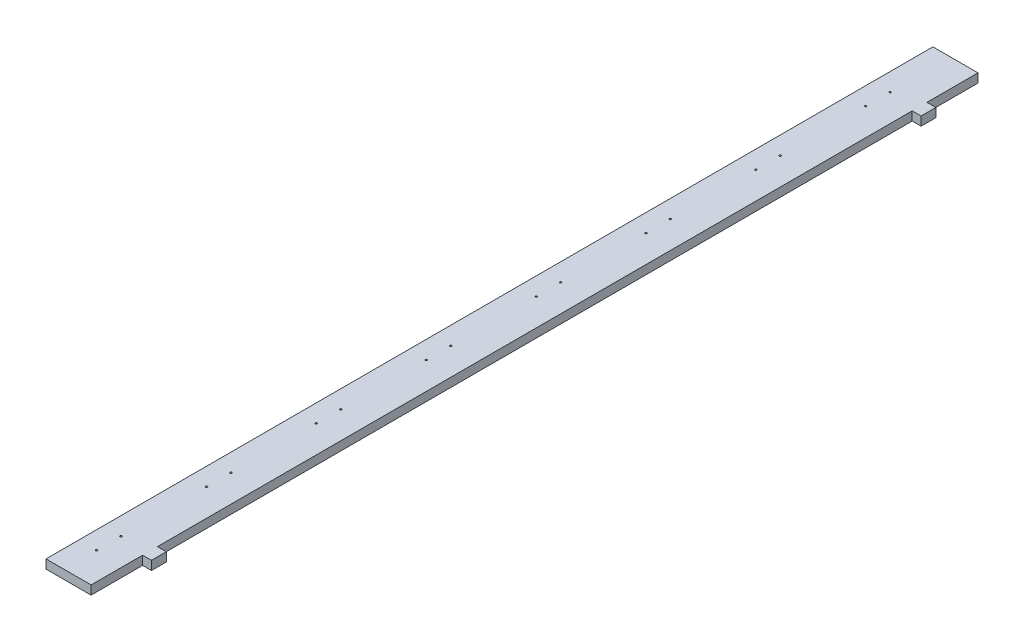
ISO-10303-21;
HEADER;
FILE_DESCRIPTION(('STEP AP214'),'2;1');
FILE_NAME('part.step','',(''),(''),'','','');
FILE_SCHEMA(('AUTOMOTIVE_DESIGN { 1 0 10303 214 1 1 1 1 }'));
ENDSEC;
DATA;
#1=APPLICATION_CONTEXT('core data for automotive mechanical design processes');
#2=APPLICATION_PROTOCOL_DEFINITION('international standard','automotive_design',2000,#1);
#3=PRODUCT_CONTEXT('',#1,'mechanical');
#4=PRODUCT('Part','Part','',(#3));
#5=PRODUCT_RELATED_PRODUCT_CATEGORY('part','',(#4));
#6=PRODUCT_DEFINITION_FORMATION('','',#4);
#7=PRODUCT_DEFINITION_CONTEXT('part definition',#1,'design');
#8=PRODUCT_DEFINITION('design','',#6,#7);
#9=PRODUCT_DEFINITION_SHAPE('','',#8);
#10=(LENGTH_UNIT() NAMED_UNIT(*) SI_UNIT(.MILLI.,.METRE.));
#11=(NAMED_UNIT(*) PLANE_ANGLE_UNIT() SI_UNIT($,.RADIAN.));
#12=(NAMED_UNIT(*) SI_UNIT($,.STERADIAN.) SOLID_ANGLE_UNIT());
#13=UNCERTAINTY_MEASURE_WITH_UNIT(LENGTH_MEASURE(1.E-05),#10,'distance_accuracy_value','');
#14=(GEOMETRIC_REPRESENTATION_CONTEXT(3) GLOBAL_UNCERTAINTY_ASSIGNED_CONTEXT((#13)) GLOBAL_UNIT_ASSIGNED_CONTEXT((#10,
#11,#12)) REPRESENTATION_CONTEXT('',''));
#15=CARTESIAN_POINT('',(0.,0.,0.));
#16=DIRECTION('',(0.,0.,1.));
#17=DIRECTION('',(1.,0.,0.));
#18=AXIS2_PLACEMENT_3D('',#15,#16,#17);
#19=CARTESIAN_POINT('',(61.,12.,0.));
#20=DIRECTION('',(-1.,0.,0.));
#21=DIRECTION('',(0.,0.,1.));
#22=AXIS2_PLACEMENT_3D('',#19,#20,#21);
#23=PLANE('',#22);
#24=DIRECTION('',(0.,0.,-1.));
#25=VECTOR('',#24,1.);
#26=CARTESIAN_POINT('',(61.,12.,0.));
#27=LINE('',#26,#25);
#28=CARTESIAN_POINT('',(61.,12.,-1130.95));
#29=VERTEX_POINT('',#28);
#30=CARTESIAN_POINT('',(61.,12.,-1200.));
#31=VERTEX_POINT('',#30);
#32=EDGE_CURVE('E255',#29,#31,#27,.T.);
#33=ORIENTED_EDGE('',*,*,#32,.F.);
#34=DIRECTION('',(0.,-1.,0.));
#35=VECTOR('',#34,1.);
#36=CARTESIAN_POINT('',(61.,12.,-1130.95));
#37=LINE('',#36,#35);
#38=CARTESIAN_POINT('',(61.,0.,-1130.95));
#39=VERTEX_POINT('',#38);
#40=EDGE_CURVE('E160',#29,#39,#37,.T.);
#41=ORIENTED_EDGE('',*,*,#40,.T.);
#42=DIRECTION('',(0.,0.,-1.));
#43=VECTOR('',#42,1.);
#44=CARTESIAN_POINT('',(61.,0.,0.));
#45=LINE('',#44,#43);
#46=CARTESIAN_POINT('',(61.,0.,-1200.));
#47=VERTEX_POINT('',#46);
#48=EDGE_CURVE('E268',#39,#47,#45,.T.);
#49=ORIENTED_EDGE('',*,*,#48,.T.);
#50=DIRECTION('',(0.,-1.,0.));
#51=VECTOR('',#50,1.);
#52=CARTESIAN_POINT('',(61.,12.,-1200.));
#53=LINE('',#52,#51);
#54=EDGE_CURVE('E276',#31,#47,#53,.T.);
#55=ORIENTED_EDGE('',*,*,#54,.F.);
#56=EDGE_LOOP('',(#33,#41,#49,#55));
#57=FACE_BOUND('',#56,.T.);
#58=ADVANCED_FACE('F34',(#57),#23,.F.);
#59=CARTESIAN_POINT('',(61.,0.,-89.7));
#60=VERTEX_POINT('',#59);
#61=CARTESIAN_POINT('',(61.,0.,-1110.95));
#62=VERTEX_POINT('',#61);
#63=EDGE_CURVE('E272',#60,#62,#45,.T.);
#64=ORIENTED_EDGE('',*,*,#63,.T.);
#65=DIRECTION('',(0.,1.,0.));
#66=VECTOR('',#65,1.);
#67=CARTESIAN_POINT('',(61.,12.,-1110.95));
#68=LINE('',#67,#66);
#69=CARTESIAN_POINT('',(61.,12.,-1110.95));
#70=VERTEX_POINT('',#69);
#71=EDGE_CURVE('E133',#62,#70,#68,.T.);
#72=ORIENTED_EDGE('',*,*,#71,.T.);
#73=CARTESIAN_POINT('',(61.,12.,-89.6999999999999));
#74=VERTEX_POINT('',#73);
#75=EDGE_CURVE('E260',#74,#70,#27,.T.);
#76=ORIENTED_EDGE('',*,*,#75,.F.);
#77=DIRECTION('',(0.,-1.,0.));
#78=VECTOR('',#77,1.);
#79=CARTESIAN_POINT('',(61.,12.,-89.7));
#80=LINE('',#79,#78);
#81=EDGE_CURVE('E183',#74,#60,#80,.T.);
#82=ORIENTED_EDGE('',*,*,#81,.T.);
#83=EDGE_LOOP('',(#64,#72,#76,#82));
#84=FACE_BOUND('',#83,.T.);
#85=ADVANCED_FACE('F364',(#84),#23,.F.);
#86=CARTESIAN_POINT('',(0.,12.,0.));
#87=DIRECTION('',(1.,0.,0.));
#88=DIRECTION('',(0.,0.,-1.));
#89=AXIS2_PLACEMENT_3D('',#86,#87,#88);
#90=PLANE('',#89);
#91=DIRECTION('',(0.,0.,1.));
#92=VECTOR('',#91,1.);
#93=CARTESIAN_POINT('',(0.,0.,0.));
#94=LINE('',#93,#92);
#95=CARTESIAN_POINT('',(0.,0.,-1200.));
#96=VERTEX_POINT('',#95);
#97=CARTESIAN_POINT('',(0.,0.,0.));
#98=VERTEX_POINT('',#97);
#99=EDGE_CURVE('E263',#96,#98,#94,.T.);
#100=ORIENTED_EDGE('',*,*,#99,.T.);
#101=DIRECTION('',(0.,-1.,0.));
#102=VECTOR('',#101,1.);
#103=CARTESIAN_POINT('',(0.,12.,0.));
#104=LINE('',#103,#102);
#105=CARTESIAN_POINT('',(0.,12.,0.));
#106=VERTEX_POINT('',#105);
#107=EDGE_CURVE('E11',#106,#98,#104,.T.);
#108=ORIENTED_EDGE('',*,*,#107,.F.);
#109=DIRECTION('',(0.,0.,1.));
#110=VECTOR('',#109,1.);
#111=CARTESIAN_POINT('',(0.,12.,0.));
#112=LINE('',#111,#110);
#113=CARTESIAN_POINT('',(0.,12.,-1200.));
#114=VERTEX_POINT('',#113);
#115=EDGE_CURVE('E249',#114,#106,#112,.T.);
#116=ORIENTED_EDGE('',*,*,#115,.F.);
#117=DIRECTION('',(0.,-1.,0.));
#118=VECTOR('',#117,1.);
#119=CARTESIAN_POINT('',(0.,12.,-1200.));
#120=LINE('',#119,#118);
#121=EDGE_CURVE('E262',#114,#96,#120,.T.);
#122=ORIENTED_EDGE('',*,*,#121,.T.);
#123=EDGE_LOOP('',(#100,#108,#116,#122));
#124=FACE_BOUND('',#123,.T.);
#125=ADVANCED_FACE('F36',(#124),#90,.F.);
#126=CARTESIAN_POINT('',(0.,12.,0.));
#127=DIRECTION('',(0.,0.,-1.));
#128=DIRECTION('',(-1.,0.,0.));
#129=AXIS2_PLACEMENT_3D('',#126,#127,#128);
#130=PLANE('',#129);
#131=DIRECTION('',(1.,0.,0.));
#132=VECTOR('',#131,1.);
#133=CARTESIAN_POINT('',(0.,0.,0.));
#134=LINE('',#133,#132);
#135=CARTESIAN_POINT('',(61.,0.,0.));
#136=VERTEX_POINT('',#135);
#137=EDGE_CURVE('E266',#98,#136,#134,.T.);
#138=ORIENTED_EDGE('',*,*,#137,.T.);
#139=DIRECTION('',(0.,-1.,0.));
#140=VECTOR('',#139,1.);
#141=CARTESIAN_POINT('',(61.,12.,0.));
#142=LINE('',#141,#140);
#143=CARTESIAN_POINT('',(61.,12.,0.));
#144=VERTEX_POINT('',#143);
#145=EDGE_CURVE('E43',#144,#136,#142,.T.);
#146=ORIENTED_EDGE('',*,*,#145,.F.);
#147=DIRECTION('',(1.,0.,0.));
#148=VECTOR('',#147,1.);
#149=CARTESIAN_POINT('',(0.,12.,0.));
#150=LINE('',#149,#148);
#151=EDGE_CURVE('E252',#106,#144,#150,.T.);
#152=ORIENTED_EDGE('',*,*,#151,.F.);
#153=ORIENTED_EDGE('',*,*,#107,.T.);
#154=EDGE_LOOP('',(#138,#146,#152,#153));
#155=FACE_BOUND('',#154,.T.);
#156=ADVANCED_FACE('F373',(#155),#130,.F.);
#157=CARTESIAN_POINT('',(61.,0.,-69.7));
#158=VERTEX_POINT('',#157);
#159=EDGE_CURVE('E269',#136,#158,#45,.T.);
#160=ORIENTED_EDGE('',*,*,#159,.T.);
#161=DIRECTION('',(0.,1.,0.));
#162=VECTOR('',#161,1.);
#163=CARTESIAN_POINT('',(61.,12.,-69.7));
#164=LINE('',#163,#162);
#165=CARTESIAN_POINT('',(61.,12.,-69.7));
#166=VERTEX_POINT('',#165);
#167=EDGE_CURVE('E178',#158,#166,#164,.T.);
#168=ORIENTED_EDGE('',*,*,#167,.T.);
#169=EDGE_CURVE('E256',#144,#166,#27,.T.);
#170=ORIENTED_EDGE('',*,*,#169,.F.);
#171=ORIENTED_EDGE('',*,*,#145,.T.);
#172=EDGE_LOOP('',(#160,#168,#170,#171));
#173=FACE_BOUND('',#172,.T.);
#174=ADVANCED_FACE('F359',(#173),#23,.F.);
#175=CARTESIAN_POINT('',(0.,12.,-1200.));
#176=DIRECTION('',(0.,0.,1.));
#177=DIRECTION('',(1.,0.,0.));
#178=AXIS2_PLACEMENT_3D('',#175,#176,#177);
#179=PLANE('',#178);
#180=DIRECTION('',(-1.,0.,0.));
#181=VECTOR('',#180,1.);
#182=CARTESIAN_POINT('',(0.,0.,-1200.));
#183=LINE('',#182,#181);
#184=EDGE_CURVE('E253',#47,#96,#183,.T.);
#185=ORIENTED_EDGE('',*,*,#184,.T.);
#186=ORIENTED_EDGE('',*,*,#121,.F.);
#187=DIRECTION('',(-1.,0.,0.));
#188=VECTOR('',#187,1.);
#189=CARTESIAN_POINT('',(0.,12.,-1200.));
#190=LINE('',#189,#188);
#191=EDGE_CURVE('E259',#31,#114,#190,.T.);
#192=ORIENTED_EDGE('',*,*,#191,.F.);
#193=ORIENTED_EDGE('',*,*,#54,.T.);
#194=EDGE_LOOP('',(#185,#186,#192,#193));
#195=FACE_BOUND('',#194,.T.);
#196=ADVANCED_FACE('F354',(#195),#179,.F.);
#197=CARTESIAN_POINT('',(0.,12.,-1200.));
#198=DIRECTION('',(0.,-1.,0.));
#199=DIRECTION('',(0.,0.,-1.));
#200=AXIS2_PLACEMENT_3D('',#197,#198,#199);
#201=PLANE('',#200);
#202=ORIENTED_EDGE('',*,*,#75,.T.);
#203=DIRECTION('',(1.,0.,0.));
#204=VECTOR('',#203,1.);
#205=CARTESIAN_POINT('',(49.5795479516547,12.,-1110.95));
#206=LINE('',#205,#204);
#207=CARTESIAN_POINT('',(72.9999999999964,12.,-1110.95));
#208=VERTEX_POINT('',#207);
#209=EDGE_CURVE('E154',#70,#208,#206,.T.);
#210=ORIENTED_EDGE('',*,*,#209,.T.);
#211=DIRECTION('',(0.,0.,-1.));
#212=VECTOR('',#211,1.);
#213=CARTESIAN_POINT('',(72.9999999999964,12.,-1110.95));
#214=LINE('',#213,#212);
#215=CARTESIAN_POINT('',(72.9999999999964,12.,-1130.95));
#216=VERTEX_POINT('',#215);
#217=EDGE_CURVE('E144',#208,#216,#214,.T.);
#218=ORIENTED_EDGE('',*,*,#217,.T.);
#219=DIRECTION('',(-1.,0.,0.));
#220=VECTOR('',#219,1.);
#221=CARTESIAN_POINT('',(49.5795479516547,12.,-1130.95));
#222=LINE('',#221,#220);
#223=EDGE_CURVE('E51',#216,#29,#222,.T.);
#224=ORIENTED_EDGE('',*,*,#223,.T.);
#225=ORIENTED_EDGE('',*,*,#32,.T.);
#226=ORIENTED_EDGE('',*,*,#191,.T.);
#227=ORIENTED_EDGE('',*,*,#115,.T.);
#228=ORIENTED_EDGE('',*,*,#151,.T.);
#229=ORIENTED_EDGE('',*,*,#169,.T.);
#230=DIRECTION('',(1.,0.,0.));
#231=VECTOR('',#230,1.);
#232=CARTESIAN_POINT('',(49.5795479516583,12.,-69.7));
#233=LINE('',#232,#231);
#234=CARTESIAN_POINT('',(73.,12.,-69.7));
#235=VERTEX_POINT('',#234);
#236=EDGE_CURVE('E163',#166,#235,#233,.T.);
#237=ORIENTED_EDGE('',*,*,#236,.T.);
#238=DIRECTION('',(0.,0.,-1.));
#239=VECTOR('',#238,1.);
#240=CARTESIAN_POINT('',(73.,12.,-69.7));
#241=LINE('',#240,#239);
#242=CARTESIAN_POINT('',(73.,12.,-89.7));
#243=VERTEX_POINT('',#242);
#244=EDGE_CURVE('E173',#235,#243,#241,.T.);
#245=ORIENTED_EDGE('',*,*,#244,.T.);
#246=DIRECTION('',(-1.,0.,0.));
#247=VECTOR('',#246,1.);
#248=CARTESIAN_POINT('',(49.5795479516583,12.,-89.7));
#249=LINE('',#248,#247);
#250=EDGE_CURVE('E58',#243,#74,#249,.T.);
#251=ORIENTED_EDGE('',*,*,#250,.T.);
#252=EDGE_LOOP('',(#202,#210,#218,#224,#225,#226,#227,#228,#229,#237,#245,#251));
#253=FACE_BOUND('',#252,.T.);
#254=CARTESIAN_POINT('',(24.1408999159327,12.,-1084.945));
#255=DIRECTION('',(0.,1.,0.));
#256=DIRECTION('',(0.,0.,1.));
#257=AXIS2_PLACEMENT_3D('',#254,#255,#256);
#258=CIRCLE('',#257,1.24999999999328);
#259=CARTESIAN_POINT('',(24.1408999159327,12.,-1083.69500000001));
#260=VERTEX_POINT('',#259);
#261=EDGE_CURVE('E186',#260,#260,#258,.T.);
#262=ORIENTED_EDGE('',*,*,#261,.F.);
#263=EDGE_LOOP('',(#262));
#264=FACE_BOUND('',#263,.T.);
#265=CARTESIAN_POINT('',(24.1408999159327,12.,-1117.945));
#266=DIRECTION('',(0.,1.,0.));
#267=DIRECTION('',(0.,0.,1.));
#268=AXIS2_PLACEMENT_3D('',#265,#266,#267);
#269=CIRCLE('',#268,1.24999999999328);
#270=CARTESIAN_POINT('',(24.1408999159327,12.,-1116.69500000001));
#271=VERTEX_POINT('',#270);
#272=EDGE_CURVE('E189',#271,#271,#269,.T.);
#273=ORIENTED_EDGE('',*,*,#272,.F.);
#274=EDGE_LOOP('',(#273));
#275=FACE_BOUND('',#274,.T.);
#276=CARTESIAN_POINT('',(24.1408999159333,12.,-936.295));
#277=DIRECTION('',(0.,1.,0.));
#278=DIRECTION('',(0.,0.,1.));
#279=AXIS2_PLACEMENT_3D('',#276,#277,#278);
#280=CIRCLE('',#279,1.24999999999325);
#281=CARTESIAN_POINT('',(24.1408999159333,12.,-935.045000000007));
#282=VERTEX_POINT('',#281);
#283=EDGE_CURVE('E193',#282,#282,#280,.T.);
#284=ORIENTED_EDGE('',*,*,#283,.F.);
#285=EDGE_LOOP('',(#284));
#286=FACE_BOUND('',#285,.T.);
#287=CARTESIAN_POINT('',(24.1408999159333,12.,-969.295));
#288=DIRECTION('',(0.,1.,0.));
#289=DIRECTION('',(0.,0.,1.));
#290=AXIS2_PLACEMENT_3D('',#287,#288,#289);
#291=CIRCLE('',#290,1.24999999999328);
#292=CARTESIAN_POINT('',(24.1408999159333,12.,-968.045000000007));
#293=VERTEX_POINT('',#292);
#294=EDGE_CURVE('E197',#293,#293,#291,.T.);
#295=ORIENTED_EDGE('',*,*,#294,.F.);
#296=EDGE_LOOP('',(#295));
#297=FACE_BOUND('',#296,.T.);
#298=CARTESIAN_POINT('',(24.1408999159338,12.,-787.645));
#299=DIRECTION('',(0.,1.,0.));
#300=DIRECTION('',(0.,0.,1.));
#301=AXIS2_PLACEMENT_3D('',#298,#299,#300);
#302=CIRCLE('',#301,1.24999999999325);
#303=CARTESIAN_POINT('',(24.1408999159338,12.,-786.395000000007));
#304=VERTEX_POINT('',#303);
#305=EDGE_CURVE('E201',#304,#304,#302,.T.);
#306=ORIENTED_EDGE('',*,*,#305,.F.);
#307=EDGE_LOOP('',(#306));
#308=FACE_BOUND('',#307,.T.);
#309=CARTESIAN_POINT('',(24.1408999159338,12.,-820.645));
#310=DIRECTION('',(0.,1.,0.));
#311=DIRECTION('',(0.,0.,1.));
#312=AXIS2_PLACEMENT_3D('',#309,#310,#311);
#313=CIRCLE('',#312,1.24999999999328);
#314=CARTESIAN_POINT('',(24.1408999159338,12.,-819.395000000007));
#315=VERTEX_POINT('',#314);
#316=EDGE_CURVE('E205',#315,#315,#313,.T.);
#317=ORIENTED_EDGE('',*,*,#316,.F.);
#318=EDGE_LOOP('',(#317));
#319=FACE_BOUND('',#318,.T.);
#320=CARTESIAN_POINT('',(24.1408999159343,12.,-638.995));
#321=DIRECTION('',(0.,1.,0.));
#322=DIRECTION('',(0.,0.,1.));
#323=AXIS2_PLACEMENT_3D('',#320,#321,#322);
#324=CIRCLE('',#323,1.24999999999325);
#325=CARTESIAN_POINT('',(24.1408999159343,12.,-637.745000000007));
#326=VERTEX_POINT('',#325);
#327=EDGE_CURVE('E209',#326,#326,#324,.T.);
#328=ORIENTED_EDGE('',*,*,#327,.F.);
#329=EDGE_LOOP('',(#328));
#330=FACE_BOUND('',#329,.T.);
#331=CARTESIAN_POINT('',(24.1408999159343,12.,-671.995));
#332=DIRECTION('',(0.,1.,0.));
#333=DIRECTION('',(0.,0.,1.));
#334=AXIS2_PLACEMENT_3D('',#331,#332,#333);
#335=CIRCLE('',#334,1.24999999999328);
#336=CARTESIAN_POINT('',(24.1408999159343,12.,-670.745000000007));
#337=VERTEX_POINT('',#336);
#338=EDGE_CURVE('E213',#337,#337,#335,.T.);
#339=ORIENTED_EDGE('',*,*,#338,.F.);
#340=EDGE_LOOP('',(#339));
#341=FACE_BOUND('',#340,.T.);
#342=CARTESIAN_POINT('',(24.1408999159348,12.,-490.345));
#343=DIRECTION('',(0.,1.,0.));
#344=DIRECTION('',(0.,0.,1.));
#345=AXIS2_PLACEMENT_3D('',#342,#343,#344);
#346=CIRCLE('',#345,1.24999999999328);
#347=CARTESIAN_POINT('',(24.1408999159348,12.,-489.095000000007));
#348=VERTEX_POINT('',#347);
#349=EDGE_CURVE('E217',#348,#348,#346,.T.);
#350=ORIENTED_EDGE('',*,*,#349,.F.);
#351=EDGE_LOOP('',(#350));
#352=FACE_BOUND('',#351,.T.);
#353=CARTESIAN_POINT('',(24.1408999159348,12.,-523.345));
#354=DIRECTION('',(0.,1.,0.));
#355=DIRECTION('',(0.,0.,1.));
#356=AXIS2_PLACEMENT_3D('',#353,#354,#355);
#357=CIRCLE('',#356,1.24999999999328);
#358=CARTESIAN_POINT('',(24.1408999159348,12.,-522.095000000007));
#359=VERTEX_POINT('',#358);
#360=EDGE_CURVE('E221',#359,#359,#357,.T.);
#361=ORIENTED_EDGE('',*,*,#360,.F.);
#362=EDGE_LOOP('',(#361));
#363=FACE_BOUND('',#362,.T.);
#364=CARTESIAN_POINT('',(24.1408999159353,12.,-341.695));
#365=DIRECTION('',(0.,1.,0.));
#366=DIRECTION('',(0.,0.,1.));
#367=AXIS2_PLACEMENT_3D('',#364,#365,#366);
#368=CIRCLE('',#367,1.24999999999328);
#369=CARTESIAN_POINT('',(24.1408999159353,12.,-340.445000000007));
#370=VERTEX_POINT('',#369);
#371=EDGE_CURVE('E225',#370,#370,#368,.T.);
#372=ORIENTED_EDGE('',*,*,#371,.F.);
#373=EDGE_LOOP('',(#372));
#374=FACE_BOUND('',#373,.T.);
#375=CARTESIAN_POINT('',(24.1408999159353,12.,-374.695));
#376=DIRECTION('',(0.,1.,0.));
#377=DIRECTION('',(0.,0.,1.));
#378=AXIS2_PLACEMENT_3D('',#375,#376,#377);
#379=CIRCLE('',#378,1.24999999999328);
#380=CARTESIAN_POINT('',(24.1408999159353,12.,-373.445000000007));
#381=VERTEX_POINT('',#380);
#382=EDGE_CURVE('E229',#381,#381,#379,.T.);
#383=ORIENTED_EDGE('',*,*,#382,.F.);
#384=EDGE_LOOP('',(#383));
#385=FACE_BOUND('',#384,.T.);
#386=CARTESIAN_POINT('',(24.1408999159359,12.,-193.045));
#387=DIRECTION('',(0.,1.,0.));
#388=DIRECTION('',(0.,0.,1.));
#389=AXIS2_PLACEMENT_3D('',#386,#387,#388);
#390=CIRCLE('',#389,1.24999999999328);
#391=CARTESIAN_POINT('',(24.1408999159359,12.,-191.795000000007));
#392=VERTEX_POINT('',#391);
#393=EDGE_CURVE('E233',#392,#392,#390,.T.);
#394=ORIENTED_EDGE('',*,*,#393,.F.);
#395=EDGE_LOOP('',(#394));
#396=FACE_BOUND('',#395,.T.);
#397=CARTESIAN_POINT('',(24.1408999159359,12.,-226.045));
#398=DIRECTION('',(0.,1.,0.));
#399=DIRECTION('',(0.,0.,1.));
#400=AXIS2_PLACEMENT_3D('',#397,#398,#399);
#401=CIRCLE('',#400,1.24999999999328);
#402=CARTESIAN_POINT('',(24.1408999159359,12.,-224.795000000007));
#403=VERTEX_POINT('',#402);
#404=EDGE_CURVE('E237',#403,#403,#401,.T.);
#405=ORIENTED_EDGE('',*,*,#404,.F.);
#406=EDGE_LOOP('',(#405));
#407=FACE_BOUND('',#406,.T.);
#408=CARTESIAN_POINT('',(24.1408999159364,12.,-44.3950000000002));
#409=DIRECTION('',(0.,1.,0.));
#410=DIRECTION('',(0.,0.,1.));
#411=AXIS2_PLACEMENT_3D('',#408,#409,#410);
#412=CIRCLE('',#411,1.24999999999328);
#413=CARTESIAN_POINT('',(24.1408999159364,12.,-43.145000000007));
#414=VERTEX_POINT('',#413);
#415=EDGE_CURVE('E241',#414,#414,#412,.T.);
#416=ORIENTED_EDGE('',*,*,#415,.F.);
#417=EDGE_LOOP('',(#416));
#418=FACE_BOUND('',#417,.T.);
#419=CARTESIAN_POINT('',(24.1408999159364,12.,-77.3950000000002));
#420=DIRECTION('',(0.,1.,0.));
#421=DIRECTION('',(0.,0.,1.));
#422=AXIS2_PLACEMENT_3D('',#419,#420,#421);
#423=CIRCLE('',#422,1.24999999999328);
#424=CARTESIAN_POINT('',(24.1408999159364,12.,-76.145000000007));
#425=VERTEX_POINT('',#424);
#426=EDGE_CURVE('E245',#425,#425,#423,.T.);
#427=ORIENTED_EDGE('',*,*,#426,.F.);
#428=EDGE_LOOP('',(#427));
#429=FACE_BOUND('',#428,.T.);
#430=ADVANCED_FACE('F317',(#253,#264,#275,#286,#297,#308,#319,#330,#341,#352,#363,#374,#385,
#396,#407,#418,#429),#201,.F.);
#431=CARTESIAN_POINT('',(0.,0.,-1200.));
#432=DIRECTION('',(0.,-1.,0.));
#433=DIRECTION('',(0.,0.,-1.));
#434=AXIS2_PLACEMENT_3D('',#431,#432,#433);
#435=PLANE('',#434);
#436=ORIENTED_EDGE('',*,*,#48,.F.);
#437=DIRECTION('',(-1.,0.,0.));
#438=VECTOR('',#437,1.);
#439=CARTESIAN_POINT('',(49.5795479516547,0.,-1130.95));
#440=LINE('',#439,#438);
#441=CARTESIAN_POINT('',(72.9999999999964,0.,-1130.95));
#442=VERTEX_POINT('',#441);
#443=EDGE_CURVE('E146',#442,#39,#440,.T.);
#444=ORIENTED_EDGE('',*,*,#443,.F.);
#445=DIRECTION('',(0.,0.,-1.));
#446=VECTOR('',#445,1.);
#447=CARTESIAN_POINT('',(72.9999999999964,0.,-1110.95));
#448=LINE('',#447,#446);
#449=CARTESIAN_POINT('',(72.9999999999964,0.,-1110.95));
#450=VERTEX_POINT('',#449);
#451=EDGE_CURVE('E138',#450,#442,#448,.T.);
#452=ORIENTED_EDGE('',*,*,#451,.F.);
#453=DIRECTION('',(1.,0.,0.));
#454=VECTOR('',#453,1.);
#455=CARTESIAN_POINT('',(49.5795479516547,0.,-1110.95));
#456=LINE('',#455,#454);
#457=EDGE_CURVE('E127',#62,#450,#456,.T.);
#458=ORIENTED_EDGE('',*,*,#457,.F.);
#459=ORIENTED_EDGE('',*,*,#63,.F.);
#460=DIRECTION('',(-1.,0.,0.));
#461=VECTOR('',#460,1.);
#462=CARTESIAN_POINT('',(49.5795479516583,0.,-89.7));
#463=LINE('',#462,#461);
#464=CARTESIAN_POINT('',(73.,0.,-89.7));
#465=VERTEX_POINT('',#464);
#466=EDGE_CURVE('E169',#465,#60,#463,.T.);
#467=ORIENTED_EDGE('',*,*,#466,.F.);
#468=DIRECTION('',(0.,0.,-1.));
#469=VECTOR('',#468,1.);
#470=CARTESIAN_POINT('',(73.,0.,-69.7));
#471=LINE('',#470,#469);
#472=CARTESIAN_POINT('',(73.,0.,-69.7));
#473=VERTEX_POINT('',#472);
#474=EDGE_CURVE('E166',#473,#465,#471,.T.);
#475=ORIENTED_EDGE('',*,*,#474,.F.);
#476=DIRECTION('',(1.,0.,0.));
#477=VECTOR('',#476,1.);
#478=CARTESIAN_POINT('',(49.5795479516583,0.,-69.7));
#479=LINE('',#478,#477);
#480=EDGE_CURVE('E164',#158,#473,#479,.T.);
#481=ORIENTED_EDGE('',*,*,#480,.F.);
#482=ORIENTED_EDGE('',*,*,#159,.F.);
#483=ORIENTED_EDGE('',*,*,#137,.F.);
#484=ORIENTED_EDGE('',*,*,#99,.F.);
#485=ORIENTED_EDGE('',*,*,#184,.F.);
#486=EDGE_LOOP('',(#436,#444,#452,#458,#459,#467,#475,#481,#482,#483,#484,#485));
#487=FACE_BOUND('',#486,.T.);
#488=CARTESIAN_POINT('',(24.1408999159327,0.,-1084.945));
#489=DIRECTION('',(0.,-1.,0.));
#490=DIRECTION('',(0.,0.,-1.));
#491=AXIS2_PLACEMENT_3D('',#488,#489,#490);
#492=CIRCLE('',#491,1.24999999999328);
#493=CARTESIAN_POINT('',(24.1408999159327,0.,-1086.19499999999));
#494=VERTEX_POINT('',#493);
#495=EDGE_CURVE('E38',#494,#494,#492,.T.);
#496=ORIENTED_EDGE('',*,*,#495,.F.);
#497=EDGE_LOOP('',(#496));
#498=FACE_BOUND('',#497,.T.);
#499=CARTESIAN_POINT('',(24.1408999159327,0.,-1117.945));
#500=DIRECTION('',(0.,-1.,0.));
#501=DIRECTION('',(0.,0.,-1.));
#502=AXIS2_PLACEMENT_3D('',#499,#500,#501);
#503=CIRCLE('',#502,1.24999999999328);
#504=CARTESIAN_POINT('',(24.1408999159327,0.,-1119.19499999999));
#505=VERTEX_POINT('',#504);
#506=EDGE_CURVE('E192',#505,#505,#503,.T.);
#507=ORIENTED_EDGE('',*,*,#506,.F.);
#508=EDGE_LOOP('',(#507));
#509=FACE_BOUND('',#508,.T.);
#510=CARTESIAN_POINT('',(24.1408999159333,0.,-936.295));
#511=DIRECTION('',(0.,-1.,0.));
#512=DIRECTION('',(0.,0.,-1.));
#513=AXIS2_PLACEMENT_3D('',#510,#511,#512);
#514=CIRCLE('',#513,1.24999999999325);
#515=CARTESIAN_POINT('',(24.1408999159333,0.,-937.544999999993));
#516=VERTEX_POINT('',#515);
#517=EDGE_CURVE('E196',#516,#516,#514,.T.);
#518=ORIENTED_EDGE('',*,*,#517,.F.);
#519=EDGE_LOOP('',(#518));
#520=FACE_BOUND('',#519,.T.);
#521=CARTESIAN_POINT('',(24.1408999159333,0.,-969.295));
#522=DIRECTION('',(0.,-1.,0.));
#523=DIRECTION('',(0.,0.,-1.));
#524=AXIS2_PLACEMENT_3D('',#521,#522,#523);
#525=CIRCLE('',#524,1.24999999999328);
#526=CARTESIAN_POINT('',(24.1408999159333,0.,-970.544999999994));
#527=VERTEX_POINT('',#526);
#528=EDGE_CURVE('E200',#527,#527,#525,.T.);
#529=ORIENTED_EDGE('',*,*,#528,.F.);
#530=EDGE_LOOP('',(#529));
#531=FACE_BOUND('',#530,.T.);
#532=CARTESIAN_POINT('',(24.1408999159338,0.,-787.645));
#533=DIRECTION('',(0.,-1.,0.));
#534=DIRECTION('',(0.,0.,-1.));
#535=AXIS2_PLACEMENT_3D('',#532,#533,#534);
#536=CIRCLE('',#535,1.24999999999325);
#537=CARTESIAN_POINT('',(24.1408999159338,0.,-788.894999999994));
#538=VERTEX_POINT('',#537);
#539=EDGE_CURVE('E204',#538,#538,#536,.T.);
#540=ORIENTED_EDGE('',*,*,#539,.F.);
#541=EDGE_LOOP('',(#540));
#542=FACE_BOUND('',#541,.T.);
#543=CARTESIAN_POINT('',(24.1408999159338,0.,-820.645));
#544=DIRECTION('',(0.,-1.,0.));
#545=DIRECTION('',(0.,0.,-1.));
#546=AXIS2_PLACEMENT_3D('',#543,#544,#545);
#547=CIRCLE('',#546,1.24999999999328);
#548=CARTESIAN_POINT('',(24.1408999159338,0.,-821.894999999994));
#549=VERTEX_POINT('',#548);
#550=EDGE_CURVE('E208',#549,#549,#547,.T.);
#551=ORIENTED_EDGE('',*,*,#550,.F.);
#552=EDGE_LOOP('',(#551));
#553=FACE_BOUND('',#552,.T.);
#554=CARTESIAN_POINT('',(24.1408999159343,0.,-638.995));
#555=DIRECTION('',(0.,-1.,0.));
#556=DIRECTION('',(0.,0.,-1.));
#557=AXIS2_PLACEMENT_3D('',#554,#555,#556);
#558=CIRCLE('',#557,1.24999999999325);
#559=CARTESIAN_POINT('',(24.1408999159343,0.,-640.244999999994));
#560=VERTEX_POINT('',#559);
#561=EDGE_CURVE('E212',#560,#560,#558,.T.);
#562=ORIENTED_EDGE('',*,*,#561,.F.);
#563=EDGE_LOOP('',(#562));
#564=FACE_BOUND('',#563,.T.);
#565=CARTESIAN_POINT('',(24.1408999159343,0.,-671.995));
#566=DIRECTION('',(0.,-1.,0.));
#567=DIRECTION('',(0.,0.,-1.));
#568=AXIS2_PLACEMENT_3D('',#565,#566,#567);
#569=CIRCLE('',#568,1.24999999999328);
#570=CARTESIAN_POINT('',(24.1408999159343,0.,-673.244999999994));
#571=VERTEX_POINT('',#570);
#572=EDGE_CURVE('E216',#571,#571,#569,.T.);
#573=ORIENTED_EDGE('',*,*,#572,.F.);
#574=EDGE_LOOP('',(#573));
#575=FACE_BOUND('',#574,.T.);
#576=CARTESIAN_POINT('',(24.1408999159348,0.,-490.345));
#577=DIRECTION('',(0.,-1.,0.));
#578=DIRECTION('',(0.,0.,-1.));
#579=AXIS2_PLACEMENT_3D('',#576,#577,#578);
#580=CIRCLE('',#579,1.24999999999328);
#581=CARTESIAN_POINT('',(24.1408999159348,0.,-491.594999999993));
#582=VERTEX_POINT('',#581);
#583=EDGE_CURVE('E220',#582,#582,#580,.T.);
#584=ORIENTED_EDGE('',*,*,#583,.F.);
#585=EDGE_LOOP('',(#584));
#586=FACE_BOUND('',#585,.T.);
#587=CARTESIAN_POINT('',(24.1408999159348,0.,-523.345));
#588=DIRECTION('',(0.,-1.,0.));
#589=DIRECTION('',(0.,0.,-1.));
#590=AXIS2_PLACEMENT_3D('',#587,#588,#589);
#591=CIRCLE('',#590,1.24999999999328);
#592=CARTESIAN_POINT('',(24.1408999159348,0.,-524.594999999994));
#593=VERTEX_POINT('',#592);
#594=EDGE_CURVE('E224',#593,#593,#591,.T.);
#595=ORIENTED_EDGE('',*,*,#594,.F.);
#596=EDGE_LOOP('',(#595));
#597=FACE_BOUND('',#596,.T.);
#598=CARTESIAN_POINT('',(24.1408999159353,0.,-341.695));
#599=DIRECTION('',(0.,-1.,0.));
#600=DIRECTION('',(0.,0.,-1.));
#601=AXIS2_PLACEMENT_3D('',#598,#599,#600);
#602=CIRCLE('',#601,1.24999999999328);
#603=CARTESIAN_POINT('',(24.1408999159353,0.,-342.944999999994));
#604=VERTEX_POINT('',#603);
#605=EDGE_CURVE('E228',#604,#604,#602,.T.);
#606=ORIENTED_EDGE('',*,*,#605,.F.);
#607=EDGE_LOOP('',(#606));
#608=FACE_BOUND('',#607,.T.);
#609=CARTESIAN_POINT('',(24.1408999159353,0.,-374.695));
#610=DIRECTION('',(0.,-1.,0.));
#611=DIRECTION('',(0.,0.,-1.));
#612=AXIS2_PLACEMENT_3D('',#609,#610,#611);
#613=CIRCLE('',#612,1.24999999999328);
#614=CARTESIAN_POINT('',(24.1408999159353,0.,-375.944999999993));
#615=VERTEX_POINT('',#614);
#616=EDGE_CURVE('E232',#615,#615,#613,.T.);
#617=ORIENTED_EDGE('',*,*,#616,.F.);
#618=EDGE_LOOP('',(#617));
#619=FACE_BOUND('',#618,.T.);
#620=CARTESIAN_POINT('',(24.1408999159359,0.,-193.045));
#621=DIRECTION('',(0.,-1.,0.));
#622=DIRECTION('',(0.,0.,-1.));
#623=AXIS2_PLACEMENT_3D('',#620,#621,#622);
#624=CIRCLE('',#623,1.24999999999328);
#625=CARTESIAN_POINT('',(24.1408999159359,0.,-194.294999999994));
#626=VERTEX_POINT('',#625);
#627=EDGE_CURVE('E236',#626,#626,#624,.T.);
#628=ORIENTED_EDGE('',*,*,#627,.F.);
#629=EDGE_LOOP('',(#628));
#630=FACE_BOUND('',#629,.T.);
#631=CARTESIAN_POINT('',(24.1408999159359,0.,-226.045));
#632=DIRECTION('',(0.,-1.,0.));
#633=DIRECTION('',(0.,0.,-1.));
#634=AXIS2_PLACEMENT_3D('',#631,#632,#633);
#635=CIRCLE('',#634,1.24999999999328);
#636=CARTESIAN_POINT('',(24.1408999159359,0.,-227.294999999994));
#637=VERTEX_POINT('',#636);
#638=EDGE_CURVE('E240',#637,#637,#635,.T.);
#639=ORIENTED_EDGE('',*,*,#638,.F.);
#640=EDGE_LOOP('',(#639));
#641=FACE_BOUND('',#640,.T.);
#642=CARTESIAN_POINT('',(24.1408999159364,0.,-44.3950000000002));
#643=DIRECTION('',(0.,-1.,0.));
#644=DIRECTION('',(0.,0.,-1.));
#645=AXIS2_PLACEMENT_3D('',#642,#643,#644);
#646=CIRCLE('',#645,1.24999999999328);
#647=CARTESIAN_POINT('',(24.1408999159364,0.,-45.6449999999935));
#648=VERTEX_POINT('',#647);
#649=EDGE_CURVE('E244',#648,#648,#646,.T.);
#650=ORIENTED_EDGE('',*,*,#649,.F.);
#651=EDGE_LOOP('',(#650));
#652=FACE_BOUND('',#651,.T.);
#653=CARTESIAN_POINT('',(24.1408999159364,0.,-77.3950000000002));
#654=DIRECTION('',(0.,-1.,0.));
#655=DIRECTION('',(0.,0.,-1.));
#656=AXIS2_PLACEMENT_3D('',#653,#654,#655);
#657=CIRCLE('',#656,1.24999999999328);
#658=CARTESIAN_POINT('',(24.1408999159364,0.,-78.6449999999935));
#659=VERTEX_POINT('',#658);
#660=EDGE_CURVE('E248',#659,#659,#657,.T.);
#661=ORIENTED_EDGE('',*,*,#660,.F.);
#662=EDGE_LOOP('',(#661));
#663=FACE_BOUND('',#662,.T.);
#664=ADVANCED_FACE('F149',(#487,#498,#509,#520,#531,#542,#553,#564,#575,#586,#597,#608,#619,
#630,#641,#652,#663),#435,.T.);
#665=CARTESIAN_POINT('',(24.1408999159364,-8.,-77.3950000000002));
#666=DIRECTION('',(0.,1.,0.));
#667=DIRECTION('',(0.,0.,1.));
#668=AXIS2_PLACEMENT_3D('',#665,#666,#667);
#669=CYLINDRICAL_SURFACE('',#668,1.24999999999328);
#670=ORIENTED_EDGE('',*,*,#660,.T.);
#671=EDGE_LOOP('',(#670));
#672=FACE_BOUND('',#671,.T.);
#673=ORIENTED_EDGE('',*,*,#426,.T.);
#674=EDGE_LOOP('',(#673));
#675=FACE_BOUND('',#674,.T.);
#676=ADVANCED_FACE('F316',(#672,#675),#669,.F.);
#677=CARTESIAN_POINT('',(24.1408999159364,-8.,-44.3950000000002));
#678=DIRECTION('',(0.,1.,0.));
#679=DIRECTION('',(0.,0.,1.));
#680=AXIS2_PLACEMENT_3D('',#677,#678,#679);
#681=CYLINDRICAL_SURFACE('',#680,1.24999999999328);
#682=ORIENTED_EDGE('',*,*,#649,.T.);
#683=EDGE_LOOP('',(#682));
#684=FACE_BOUND('',#683,.T.);
#685=ORIENTED_EDGE('',*,*,#415,.T.);
#686=EDGE_LOOP('',(#685));
#687=FACE_BOUND('',#686,.T.);
#688=ADVANCED_FACE('F349',(#684,#687),#681,.F.);
#689=CARTESIAN_POINT('',(24.1408999159359,-8.,-226.045));
#690=DIRECTION('',(0.,1.,0.));
#691=DIRECTION('',(0.,0.,1.));
#692=AXIS2_PLACEMENT_3D('',#689,#690,#691);
#693=CYLINDRICAL_SURFACE('',#692,1.24999999999328);
#694=ORIENTED_EDGE('',*,*,#638,.T.);
#695=EDGE_LOOP('',(#694));
#696=FACE_BOUND('',#695,.T.);
#697=ORIENTED_EDGE('',*,*,#404,.T.);
#698=EDGE_LOOP('',(#697));
#699=FACE_BOUND('',#698,.T.);
#700=ADVANCED_FACE('F435',(#696,#699),#693,.F.);
#701=CARTESIAN_POINT('',(24.1408999159359,-8.,-193.045));
#702=DIRECTION('',(0.,1.,0.));
#703=DIRECTION('',(0.,0.,1.));
#704=AXIS2_PLACEMENT_3D('',#701,#702,#703);
#705=CYLINDRICAL_SURFACE('',#704,1.24999999999328);
#706=ORIENTED_EDGE('',*,*,#627,.T.);
#707=EDGE_LOOP('',(#706));
#708=FACE_BOUND('',#707,.T.);
#709=ORIENTED_EDGE('',*,*,#393,.T.);
#710=EDGE_LOOP('',(#709));
#711=FACE_BOUND('',#710,.T.);
#712=ADVANCED_FACE('F445',(#708,#711),#705,.F.);
#713=CARTESIAN_POINT('',(24.1408999159353,-8.,-374.695));
#714=DIRECTION('',(0.,1.,0.));
#715=DIRECTION('',(0.,0.,1.));
#716=AXIS2_PLACEMENT_3D('',#713,#714,#715);
#717=CYLINDRICAL_SURFACE('',#716,1.24999999999328);
#718=ORIENTED_EDGE('',*,*,#616,.T.);
#719=EDGE_LOOP('',(#718));
#720=FACE_BOUND('',#719,.T.);
#721=ORIENTED_EDGE('',*,*,#382,.T.);
#722=EDGE_LOOP('',(#721));
#723=FACE_BOUND('',#722,.T.);
#724=ADVANCED_FACE('F455',(#720,#723),#717,.F.);
#725=CARTESIAN_POINT('',(24.1408999159353,-8.,-341.695));
#726=DIRECTION('',(0.,1.,0.));
#727=DIRECTION('',(0.,0.,1.));
#728=AXIS2_PLACEMENT_3D('',#725,#726,#727);
#729=CYLINDRICAL_SURFACE('',#728,1.24999999999328);
#730=ORIENTED_EDGE('',*,*,#605,.T.);
#731=EDGE_LOOP('',(#730));
#732=FACE_BOUND('',#731,.T.);
#733=ORIENTED_EDGE('',*,*,#371,.T.);
#734=EDGE_LOOP('',(#733));
#735=FACE_BOUND('',#734,.T.);
#736=ADVANCED_FACE('F465',(#732,#735),#729,.F.);
#737=CARTESIAN_POINT('',(24.1408999159348,-8.,-523.345));
#738=DIRECTION('',(0.,1.,0.));
#739=DIRECTION('',(0.,0.,1.));
#740=AXIS2_PLACEMENT_3D('',#737,#738,#739);
#741=CYLINDRICAL_SURFACE('',#740,1.24999999999328);
#742=ORIENTED_EDGE('',*,*,#594,.T.);
#743=EDGE_LOOP('',(#742));
#744=FACE_BOUND('',#743,.T.);
#745=ORIENTED_EDGE('',*,*,#360,.T.);
#746=EDGE_LOOP('',(#745));
#747=FACE_BOUND('',#746,.T.);
#748=ADVANCED_FACE('F475',(#744,#747),#741,.F.);
#749=CARTESIAN_POINT('',(24.1408999159348,-8.,-490.345));
#750=DIRECTION('',(0.,1.,0.));
#751=DIRECTION('',(0.,0.,1.));
#752=AXIS2_PLACEMENT_3D('',#749,#750,#751);
#753=CYLINDRICAL_SURFACE('',#752,1.24999999999328);
#754=ORIENTED_EDGE('',*,*,#583,.T.);
#755=EDGE_LOOP('',(#754));
#756=FACE_BOUND('',#755,.T.);
#757=ORIENTED_EDGE('',*,*,#349,.T.);
#758=EDGE_LOOP('',(#757));
#759=FACE_BOUND('',#758,.T.);
#760=ADVANCED_FACE('F485',(#756,#759),#753,.F.);
#761=CARTESIAN_POINT('',(24.1408999159343,-8.,-671.995));
#762=DIRECTION('',(0.,1.,0.));
#763=DIRECTION('',(0.,0.,1.));
#764=AXIS2_PLACEMENT_3D('',#761,#762,#763);
#765=CYLINDRICAL_SURFACE('',#764,1.24999999999328);
#766=ORIENTED_EDGE('',*,*,#572,.T.);
#767=EDGE_LOOP('',(#766));
#768=FACE_BOUND('',#767,.T.);
#769=ORIENTED_EDGE('',*,*,#338,.T.);
#770=EDGE_LOOP('',(#769));
#771=FACE_BOUND('',#770,.T.);
#772=ADVANCED_FACE('F495',(#768,#771),#765,.F.);
#773=CARTESIAN_POINT('',(24.1408999159343,-8.,-638.995));
#774=DIRECTION('',(0.,1.,0.));
#775=DIRECTION('',(0.,0.,1.));
#776=AXIS2_PLACEMENT_3D('',#773,#774,#775);
#777=CYLINDRICAL_SURFACE('',#776,1.24999999999325);
#778=ORIENTED_EDGE('',*,*,#561,.T.);
#779=EDGE_LOOP('',(#778));
#780=FACE_BOUND('',#779,.T.);
#781=ORIENTED_EDGE('',*,*,#327,.T.);
#782=EDGE_LOOP('',(#781));
#783=FACE_BOUND('',#782,.T.);
#784=ADVANCED_FACE('F505',(#780,#783),#777,.F.);
#785=CARTESIAN_POINT('',(24.1408999159338,-8.,-820.645));
#786=DIRECTION('',(0.,1.,0.));
#787=DIRECTION('',(0.,0.,1.));
#788=AXIS2_PLACEMENT_3D('',#785,#786,#787);
#789=CYLINDRICAL_SURFACE('',#788,1.24999999999328);
#790=ORIENTED_EDGE('',*,*,#550,.T.);
#791=EDGE_LOOP('',(#790));
#792=FACE_BOUND('',#791,.T.);
#793=ORIENTED_EDGE('',*,*,#316,.T.);
#794=EDGE_LOOP('',(#793));
#795=FACE_BOUND('',#794,.T.);
#796=ADVANCED_FACE('F515',(#792,#795),#789,.F.);
#797=CARTESIAN_POINT('',(24.1408999159338,-8.,-787.645));
#798=DIRECTION('',(0.,1.,0.));
#799=DIRECTION('',(0.,0.,1.));
#800=AXIS2_PLACEMENT_3D('',#797,#798,#799);
#801=CYLINDRICAL_SURFACE('',#800,1.24999999999325);
#802=ORIENTED_EDGE('',*,*,#539,.T.);
#803=EDGE_LOOP('',(#802));
#804=FACE_BOUND('',#803,.T.);
#805=ORIENTED_EDGE('',*,*,#305,.T.);
#806=EDGE_LOOP('',(#805));
#807=FACE_BOUND('',#806,.T.);
#808=ADVANCED_FACE('F525',(#804,#807),#801,.F.);
#809=CARTESIAN_POINT('',(24.1408999159333,-8.,-969.295));
#810=DIRECTION('',(0.,1.,0.));
#811=DIRECTION('',(0.,0.,1.));
#812=AXIS2_PLACEMENT_3D('',#809,#810,#811);
#813=CYLINDRICAL_SURFACE('',#812,1.24999999999328);
#814=ORIENTED_EDGE('',*,*,#528,.T.);
#815=EDGE_LOOP('',(#814));
#816=FACE_BOUND('',#815,.T.);
#817=ORIENTED_EDGE('',*,*,#294,.T.);
#818=EDGE_LOOP('',(#817));
#819=FACE_BOUND('',#818,.T.);
#820=ADVANCED_FACE('F535',(#816,#819),#813,.F.);
#821=CARTESIAN_POINT('',(24.1408999159333,-8.,-936.295));
#822=DIRECTION('',(0.,1.,0.));
#823=DIRECTION('',(0.,0.,1.));
#824=AXIS2_PLACEMENT_3D('',#821,#822,#823);
#825=CYLINDRICAL_SURFACE('',#824,1.24999999999325);
#826=ORIENTED_EDGE('',*,*,#517,.T.);
#827=EDGE_LOOP('',(#826));
#828=FACE_BOUND('',#827,.T.);
#829=ORIENTED_EDGE('',*,*,#283,.T.);
#830=EDGE_LOOP('',(#829));
#831=FACE_BOUND('',#830,.T.);
#832=ADVANCED_FACE('F545',(#828,#831),#825,.F.);
#833=CARTESIAN_POINT('',(24.1408999159327,-8.,-1117.945));
#834=DIRECTION('',(0.,1.,0.));
#835=DIRECTION('',(0.,0.,1.));
#836=AXIS2_PLACEMENT_3D('',#833,#834,#835);
#837=CYLINDRICAL_SURFACE('',#836,1.24999999999328);
#838=ORIENTED_EDGE('',*,*,#506,.T.);
#839=EDGE_LOOP('',(#838));
#840=FACE_BOUND('',#839,.T.);
#841=ORIENTED_EDGE('',*,*,#272,.T.);
#842=EDGE_LOOP('',(#841));
#843=FACE_BOUND('',#842,.T.);
#844=ADVANCED_FACE('F311',(#840,#843),#837,.F.);
#845=CARTESIAN_POINT('',(24.1408999159327,-8.,-1084.945));
#846=DIRECTION('',(0.,1.,0.));
#847=DIRECTION('',(0.,0.,1.));
#848=AXIS2_PLACEMENT_3D('',#845,#846,#847);
#849=CYLINDRICAL_SURFACE('',#848,1.24999999999328);
#850=ORIENTED_EDGE('',*,*,#495,.T.);
#851=EDGE_LOOP('',(#850));
#852=FACE_BOUND('',#851,.T.);
#853=ORIENTED_EDGE('',*,*,#261,.T.);
#854=EDGE_LOOP('',(#853));
#855=FACE_BOUND('',#854,.T.);
#856=ADVANCED_FACE('F564',(#852,#855),#849,.F.);
#857=CARTESIAN_POINT('',(49.5795479516583,0.,-89.7));
#858=DIRECTION('',(0.,0.,-1.));
#859=DIRECTION('',(-1.,0.,0.));
#860=AXIS2_PLACEMENT_3D('',#857,#858,#859);
#861=PLANE('',#860);
#862=ORIENTED_EDGE('',*,*,#81,.F.);
#863=ORIENTED_EDGE('',*,*,#250,.F.);
#864=DIRECTION('',(0.,1.,0.));
#865=VECTOR('',#864,1.);
#866=CARTESIAN_POINT('',(73.,0.,-89.7));
#867=LINE('',#866,#865);
#868=EDGE_CURVE('E176',#465,#243,#867,.T.);
#869=ORIENTED_EDGE('',*,*,#868,.F.);
#870=ORIENTED_EDGE('',*,*,#466,.T.);
#871=EDGE_LOOP('',(#862,#863,#869,#870));
#872=FACE_BOUND('',#871,.T.);
#873=ADVANCED_FACE('F393',(#872),#861,.T.);
#874=CARTESIAN_POINT('',(49.5795479516583,0.,-69.7));
#875=DIRECTION('',(0.,0.,1.));
#876=DIRECTION('',(1.,0.,0.));
#877=AXIS2_PLACEMENT_3D('',#874,#875,#876);
#878=PLANE('',#877);
#879=ORIENTED_EDGE('',*,*,#167,.F.);
#880=ORIENTED_EDGE('',*,*,#480,.T.);
#881=DIRECTION('',(0.,1.,0.));
#882=VECTOR('',#881,1.);
#883=CARTESIAN_POINT('',(73.,0.,-69.7));
#884=LINE('',#883,#882);
#885=EDGE_CURVE('E171',#473,#235,#884,.T.);
#886=ORIENTED_EDGE('',*,*,#885,.T.);
#887=ORIENTED_EDGE('',*,*,#236,.F.);
#888=EDGE_LOOP('',(#879,#880,#886,#887));
#889=FACE_BOUND('',#888,.T.);
#890=ADVANCED_FACE('F388',(#889),#878,.T.);
#891=CARTESIAN_POINT('',(73.,0.,-69.7));
#892=DIRECTION('',(1.,0.,0.));
#893=DIRECTION('',(0.,0.,-1.));
#894=AXIS2_PLACEMENT_3D('',#891,#892,#893);
#895=PLANE('',#894);
#896=ORIENTED_EDGE('',*,*,#244,.F.);
#897=ORIENTED_EDGE('',*,*,#885,.F.);
#898=ORIENTED_EDGE('',*,*,#474,.T.);
#899=ORIENTED_EDGE('',*,*,#868,.T.);
#900=EDGE_LOOP('',(#896,#897,#898,#899));
#901=FACE_BOUND('',#900,.T.);
#902=ADVANCED_FACE('F391',(#901),#895,.T.);
#903=CARTESIAN_POINT('',(49.5795479516547,0.,-1130.95));
#904=DIRECTION('',(0.,0.,-1.));
#905=DIRECTION('',(-1.,0.,0.));
#906=AXIS2_PLACEMENT_3D('',#903,#904,#905);
#907=PLANE('',#906);
#908=ORIENTED_EDGE('',*,*,#40,.F.);
#909=ORIENTED_EDGE('',*,*,#223,.F.);
#910=DIRECTION('',(0.,1.,0.));
#911=VECTOR('',#910,1.);
#912=CARTESIAN_POINT('',(72.9999999999964,0.,-1130.95));
#913=LINE('',#912,#911);
#914=EDGE_CURVE('E145',#442,#216,#913,.T.);
#915=ORIENTED_EDGE('',*,*,#914,.F.);
#916=ORIENTED_EDGE('',*,*,#443,.T.);
#917=EDGE_LOOP('',(#908,#909,#915,#916));
#918=FACE_BOUND('',#917,.T.);
#919=ADVANCED_FACE('F621',(#918),#907,.T.);
#920=CARTESIAN_POINT('',(49.5795479516547,0.,-1110.95));
#921=DIRECTION('',(0.,0.,1.));
#922=DIRECTION('',(1.,0.,0.));
#923=AXIS2_PLACEMENT_3D('',#920,#921,#922);
#924=PLANE('',#923);
#925=ORIENTED_EDGE('',*,*,#71,.F.);
#926=ORIENTED_EDGE('',*,*,#457,.T.);
#927=DIRECTION('',(0.,1.,0.));
#928=VECTOR('',#927,1.);
#929=CARTESIAN_POINT('',(72.9999999999964,0.,-1110.95));
#930=LINE('',#929,#928);
#931=EDGE_CURVE('E130',#450,#208,#930,.T.);
#932=ORIENTED_EDGE('',*,*,#931,.T.);
#933=ORIENTED_EDGE('',*,*,#209,.F.);
#934=EDGE_LOOP('',(#925,#926,#932,#933));
#935=FACE_BOUND('',#934,.T.);
#936=ADVANCED_FACE('F129',(#935),#924,.T.);
#937=CARTESIAN_POINT('',(72.9999999999964,0.,-1110.95));
#938=DIRECTION('',(1.,0.,0.));
#939=DIRECTION('',(0.,0.,-1.));
#940=AXIS2_PLACEMENT_3D('',#937,#938,#939);
#941=PLANE('',#940);
#942=ORIENTED_EDGE('',*,*,#217,.F.);
#943=ORIENTED_EDGE('',*,*,#931,.F.);
#944=ORIENTED_EDGE('',*,*,#451,.T.);
#945=ORIENTED_EDGE('',*,*,#914,.T.);
#946=EDGE_LOOP('',(#942,#943,#944,#945));
#947=FACE_BOUND('',#946,.T.);
#948=ADVANCED_FACE('F142',(#947),#941,.T.);
#949=CLOSED_SHELL('',(#58,#85,#125,#156,#174,#196,#430,#664,#676,#688,#700,#712,#724,#736,#748,
#760,#772,#784,#796,#808,#820,#832,#844,#856,#873,#890,#902,#919,#936,#948));
#950=MANIFOLD_SOLID_BREP('B2',#949);
#951=ADVANCED_BREP_SHAPE_REPRESENTATION('',(#18,#950),#14);
#952=SHAPE_DEFINITION_REPRESENTATION(#9,#951);
ENDSEC;
END-ISO-10303-21;
